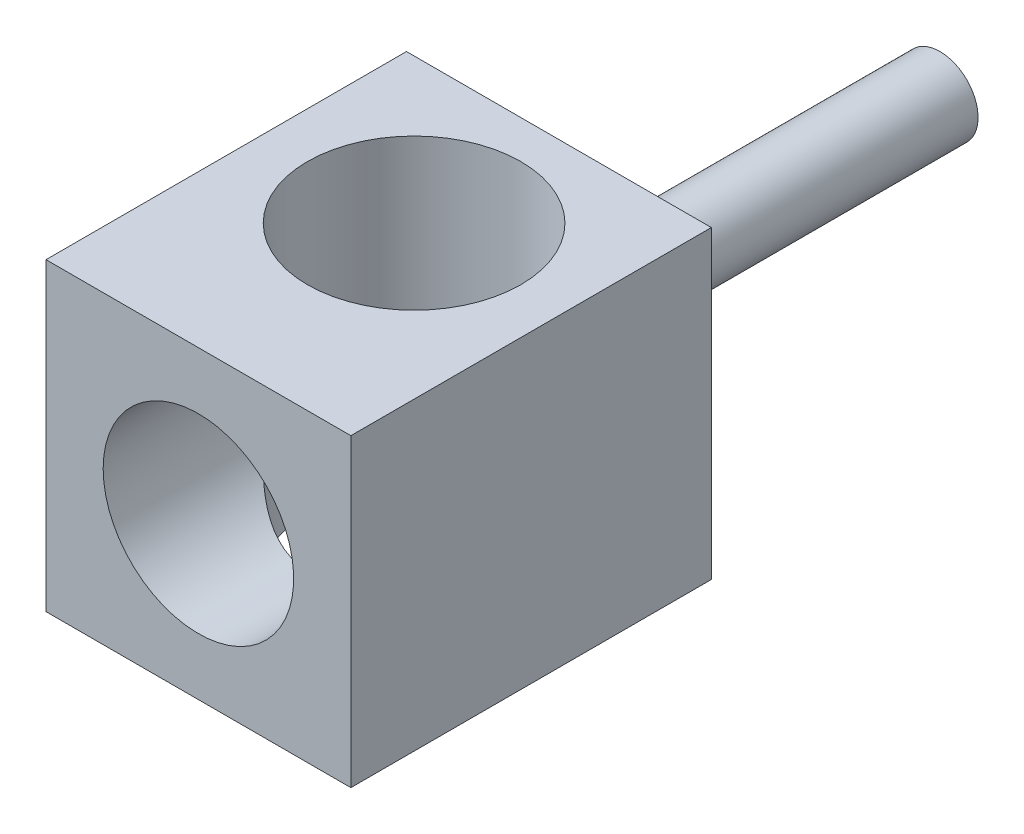
ISO-10303-21;
HEADER;
FILE_DESCRIPTION(('STEP AP214'),'2;1');
FILE_NAME('part.step','',(''),(''),'','','');
FILE_SCHEMA(('AUTOMOTIVE_DESIGN { 1 0 10303 214 1 1 1 1 }'));
ENDSEC;
DATA;
#1=APPLICATION_CONTEXT('core data for automotive mechanical design processes');
#2=APPLICATION_PROTOCOL_DEFINITION('international standard','automotive_design',2000,#1);
#3=PRODUCT_CONTEXT('',#1,'mechanical');
#4=PRODUCT('Part','Part','',(#3));
#5=PRODUCT_RELATED_PRODUCT_CATEGORY('part','',(#4));
#6=PRODUCT_DEFINITION_FORMATION('','',#4);
#7=PRODUCT_DEFINITION_CONTEXT('part definition',#1,'design');
#8=PRODUCT_DEFINITION('design','',#6,#7);
#9=PRODUCT_DEFINITION_SHAPE('','',#8);
#10=(LENGTH_UNIT() NAMED_UNIT(*) SI_UNIT(.MILLI.,.METRE.));
#11=(NAMED_UNIT(*) PLANE_ANGLE_UNIT() SI_UNIT($,.RADIAN.));
#12=(NAMED_UNIT(*) SI_UNIT($,.STERADIAN.) SOLID_ANGLE_UNIT());
#13=UNCERTAINTY_MEASURE_WITH_UNIT(LENGTH_MEASURE(1.E-05),#10,'distance_accuracy_value','');
#14=(GEOMETRIC_REPRESENTATION_CONTEXT(3) GLOBAL_UNCERTAINTY_ASSIGNED_CONTEXT((#13)) GLOBAL_UNIT_ASSIGNED_CONTEXT((#10,
#11,#12)) REPRESENTATION_CONTEXT('',''));
#15=CARTESIAN_POINT('',(0.,0.,0.));
#16=DIRECTION('',(0.,0.,1.));
#17=DIRECTION('',(1.,0.,0.));
#18=AXIS2_PLACEMENT_3D('',#15,#16,#17);
#19=CARTESIAN_POINT('',(0.,0.,-5.));
#20=DIRECTION('',(0.,0.,1.));
#21=DIRECTION('',(1.,0.,0.));
#22=AXIS2_PLACEMENT_3D('',#19,#20,#21);
#23=PLANE('',#22);
#24=CARTESIAN_POINT('',(0.,0.,-5.));
#25=DIRECTION('',(0.,0.,-1.));
#26=DIRECTION('',(-1.,0.,0.));
#27=AXIS2_PLACEMENT_3D('',#24,#25,#26);
#28=CIRCLE('',#27,0.5);
#29=CARTESIAN_POINT('',(-0.5,0.,-5.));
#30=VERTEX_POINT('',#29);
#31=EDGE_CURVE('E19',#30,#30,#28,.F.);
#32=ORIENTED_EDGE('',*,*,#31,.F.);
#33=EDGE_LOOP('',(#32));
#34=FACE_BOUND('',#33,.T.);
#35=ADVANCED_FACE('F16',(#34),#23,.F.);
#36=CARTESIAN_POINT('',(0.,0.,0.));
#37=DIRECTION('',(0.,0.,-1.));
#38=DIRECTION('',(-1.,0.,0.));
#39=AXIS2_PLACEMENT_3D('',#36,#37,#38);
#40=CYLINDRICAL_SURFACE('',#39,0.5);
#41=CARTESIAN_POINT('',(0.,0.,0.));
#42=DIRECTION('',(0.,0.,-1.));
#43=DIRECTION('',(-1.,0.,0.));
#44=AXIS2_PLACEMENT_3D('',#41,#42,#43);
#45=CIRCLE('',#44,0.5);
#46=CARTESIAN_POINT('',(-0.5,0.,0.));
#47=VERTEX_POINT('',#46);
#48=EDGE_CURVE('E87',#47,#47,#45,.T.);
#49=ORIENTED_EDGE('',*,*,#48,.T.);
#50=EDGE_LOOP('',(#49));
#51=FACE_BOUND('',#50,.T.);
#52=ORIENTED_EDGE('',*,*,#31,.T.);
#53=EDGE_LOOP('',(#52));
#54=FACE_BOUND('',#53,.T.);
#55=ADVANCED_FACE('F127',(#51,#54),#40,.T.);
#56=CARTESIAN_POINT('',(0.,0.,0.));
#57=DIRECTION('',(0.,0.,1.));
#58=DIRECTION('',(1.,0.,0.));
#59=AXIS2_PLACEMENT_3D('',#56,#57,#58);
#60=PLANE('',#59);
#61=ORIENTED_EDGE('',*,*,#48,.F.);
#62=EDGE_LOOP('',(#61));
#63=FACE_BOUND('',#62,.T.);
#64=DIRECTION('',(0.,1.,0.));
#65=VECTOR('',#64,1.);
#66=CARTESIAN_POINT('',(-2.,2.,0.));
#67=LINE('',#66,#65);
#68=CARTESIAN_POINT('',(-2.,2.,0.));
#69=VERTEX_POINT('',#68);
#70=CARTESIAN_POINT('',(-2.,-2.,0.));
#71=VERTEX_POINT('',#70);
#72=EDGE_CURVE('E56',#69,#71,#67,.F.);
#73=ORIENTED_EDGE('',*,*,#72,.F.);
#74=DIRECTION('',(1.,0.,0.));
#75=VECTOR('',#74,1.);
#76=CARTESIAN_POINT('',(2.,2.,0.));
#77=LINE('',#76,#75);
#78=CARTESIAN_POINT('',(2.,2.,0.));
#79=VERTEX_POINT('',#78);
#80=EDGE_CURVE('E74',#79,#69,#77,.F.);
#81=ORIENTED_EDGE('',*,*,#80,.F.);
#82=DIRECTION('',(0.,1.,0.));
#83=VECTOR('',#82,1.);
#84=CARTESIAN_POINT('',(2.,-2.,0.));
#85=LINE('',#84,#83);
#86=CARTESIAN_POINT('',(2.,-2.,0.));
#87=VERTEX_POINT('',#86);
#88=EDGE_CURVE('E72',#87,#79,#85,.T.);
#89=ORIENTED_EDGE('',*,*,#88,.F.);
#90=DIRECTION('',(1.,0.,0.));
#91=VECTOR('',#90,1.);
#92=CARTESIAN_POINT('',(-2.,-2.,0.));
#93=LINE('',#92,#91);
#94=EDGE_CURVE('E61',#71,#87,#93,.T.);
#95=ORIENTED_EDGE('',*,*,#94,.F.);
#96=EDGE_LOOP('',(#73,#81,#89,#95));
#97=FACE_BOUND('',#96,.T.);
#98=ADVANCED_FACE('F73',(#63,#97),#60,.F.);
#99=CARTESIAN_POINT('',(-2.,2.,0.));
#100=DIRECTION('',(-1.,0.,0.));
#101=DIRECTION('',(0.,0.,1.));
#102=AXIS2_PLACEMENT_3D('',#99,#100,#101);
#103=PLANE('',#102);
#104=DIRECTION('',(0.,1.,0.));
#105=VECTOR('',#104,1.);
#106=CARTESIAN_POINT('',(-2.,0.,4.73));
#107=LINE('',#106,#105);
#108=CARTESIAN_POINT('',(-2.,2.,4.73));
#109=VERTEX_POINT('',#108);
#110=CARTESIAN_POINT('',(-2.,-2.,4.73));
#111=VERTEX_POINT('',#110);
#112=EDGE_CURVE('E69',#109,#111,#107,.F.);
#113=ORIENTED_EDGE('',*,*,#112,.F.);
#114=DIRECTION('',(0.,0.,1.));
#115=VECTOR('',#114,1.);
#116=CARTESIAN_POINT('',(-2.,2.,0.));
#117=LINE('',#116,#115);
#118=EDGE_CURVE('E155',#69,#109,#117,.T.);
#119=ORIENTED_EDGE('',*,*,#118,.F.);
#120=ORIENTED_EDGE('',*,*,#72,.T.);
#121=DIRECTION('',(0.,0.,-1.));
#122=VECTOR('',#121,1.);
#123=CARTESIAN_POINT('',(-2.,-2.,0.));
#124=LINE('',#123,#122);
#125=EDGE_CURVE('E67',#111,#71,#124,.T.);
#126=ORIENTED_EDGE('',*,*,#125,.F.);
#127=EDGE_LOOP('',(#113,#119,#120,#126));
#128=FACE_BOUND('',#127,.T.);
#129=ADVANCED_FACE('F136',(#128),#103,.T.);
#130=CARTESIAN_POINT('',(2.,-2.,0.));
#131=DIRECTION('',(1.,0.,0.));
#132=DIRECTION('',(0.,0.,-1.));
#133=AXIS2_PLACEMENT_3D('',#130,#131,#132);
#134=PLANE('',#133);
#135=DIRECTION('',(0.,1.,0.));
#136=VECTOR('',#135,1.);
#137=CARTESIAN_POINT('',(2.,0.,4.73));
#138=LINE('',#137,#136);
#139=CARTESIAN_POINT('',(2.,-2.,4.73));
#140=VERTEX_POINT('',#139);
#141=CARTESIAN_POINT('',(2.,2.,4.73));
#142=VERTEX_POINT('',#141);
#143=EDGE_CURVE('E34',#140,#142,#138,.T.);
#144=ORIENTED_EDGE('',*,*,#143,.F.);
#145=DIRECTION('',(0.,0.,-1.));
#146=VECTOR('',#145,1.);
#147=CARTESIAN_POINT('',(2.,-2.,0.));
#148=LINE('',#147,#146);
#149=EDGE_CURVE('E66',#87,#140,#148,.F.);
#150=ORIENTED_EDGE('',*,*,#149,.F.);
#151=ORIENTED_EDGE('',*,*,#88,.T.);
#152=DIRECTION('',(0.,0.,1.));
#153=VECTOR('',#152,1.);
#154=CARTESIAN_POINT('',(2.,2.,0.));
#155=LINE('',#154,#153);
#156=EDGE_CURVE('E119',#142,#79,#155,.F.);
#157=ORIENTED_EDGE('',*,*,#156,.F.);
#158=EDGE_LOOP('',(#144,#150,#151,#157));
#159=FACE_BOUND('',#158,.T.);
#160=ADVANCED_FACE('F79',(#159),#134,.T.);
#161=CARTESIAN_POINT('',(0.,0.,4.73));
#162=DIRECTION('',(0.,0.,1.));
#163=DIRECTION('',(1.,0.,0.));
#164=AXIS2_PLACEMENT_3D('',#161,#162,#163);
#165=PLANE('',#164);
#166=CARTESIAN_POINT('',(0.,0.,4.73));
#167=DIRECTION('',(0.,0.,-1.));
#168=DIRECTION('',(-1.,0.,0.));
#169=AXIS2_PLACEMENT_3D('',#166,#167,#168);
#170=CIRCLE('',#169,1.25);
#171=CARTESIAN_POINT('',(-1.25,0.,4.73));
#172=VERTEX_POINT('',#171);
#173=EDGE_CURVE('E117',#172,#172,#170,.T.);
#174=ORIENTED_EDGE('',*,*,#173,.T.);
#175=EDGE_LOOP('',(#174));
#176=FACE_BOUND('',#175,.T.);
#177=DIRECTION('',(1.,0.,0.));
#178=VECTOR('',#177,1.);
#179=CARTESIAN_POINT('',(2.,2.,4.73));
#180=LINE('',#179,#178);
#181=EDGE_CURVE('E154',#109,#142,#180,.T.);
#182=ORIENTED_EDGE('',*,*,#181,.F.);
#183=ORIENTED_EDGE('',*,*,#112,.T.);
#184=DIRECTION('',(1.,0.,0.));
#185=VECTOR('',#184,1.);
#186=CARTESIAN_POINT('',(-2.,-2.,4.73));
#187=LINE('',#186,#185);
#188=EDGE_CURVE('E80',#140,#111,#187,.F.);
#189=ORIENTED_EDGE('',*,*,#188,.F.);
#190=ORIENTED_EDGE('',*,*,#143,.T.);
#191=EDGE_LOOP('',(#182,#183,#189,#190));
#192=FACE_BOUND('',#191,.T.);
#193=ADVANCED_FACE('F144',(#176,#192),#165,.T.);
#194=CARTESIAN_POINT('',(-2.,-2.,0.));
#195=DIRECTION('',(0.,-1.,0.));
#196=DIRECTION('',(0.,0.,-1.));
#197=AXIS2_PLACEMENT_3D('',#194,#195,#196);
#198=PLANE('',#197);
#199=CARTESIAN_POINT('',(0.,-2.,1.9));
#200=DIRECTION('',(0.,1.,0.));
#201=DIRECTION('',(0.,0.,1.));
#202=AXIS2_PLACEMENT_3D('',#199,#200,#201);
#203=CIRCLE('',#202,1.4);
#204=CARTESIAN_POINT('',(0.,-2.,3.3));
#205=VERTEX_POINT('',#204);
#206=EDGE_CURVE('E115',#205,#205,#203,.T.);
#207=ORIENTED_EDGE('',*,*,#206,.T.);
#208=EDGE_LOOP('',(#207));
#209=FACE_BOUND('',#208,.T.);
#210=ORIENTED_EDGE('',*,*,#188,.T.);
#211=ORIENTED_EDGE('',*,*,#125,.T.);
#212=ORIENTED_EDGE('',*,*,#94,.T.);
#213=ORIENTED_EDGE('',*,*,#149,.T.);
#214=EDGE_LOOP('',(#210,#211,#212,#213));
#215=FACE_BOUND('',#214,.T.);
#216=ADVANCED_FACE('F64',(#209,#215),#198,.T.);
#217=CARTESIAN_POINT('',(2.,2.,0.));
#218=DIRECTION('',(0.,1.,0.));
#219=DIRECTION('',(0.,0.,1.));
#220=AXIS2_PLACEMENT_3D('',#217,#218,#219);
#221=PLANE('',#220);
#222=CARTESIAN_POINT('',(0.,2.,1.9));
#223=DIRECTION('',(0.,1.,0.));
#224=DIRECTION('',(0.,0.,1.));
#225=AXIS2_PLACEMENT_3D('',#222,#223,#224);
#226=CIRCLE('',#225,1.4);
#227=CARTESIAN_POINT('',(0.,2.,3.3));
#228=VERTEX_POINT('',#227);
#229=EDGE_CURVE('E25',#228,#228,#226,.F.);
#230=ORIENTED_EDGE('',*,*,#229,.T.);
#231=EDGE_LOOP('',(#230));
#232=FACE_BOUND('',#231,.T.);
#233=ORIENTED_EDGE('',*,*,#181,.T.);
#234=ORIENTED_EDGE('',*,*,#156,.T.);
#235=ORIENTED_EDGE('',*,*,#80,.T.);
#236=ORIENTED_EDGE('',*,*,#118,.T.);
#237=EDGE_LOOP('',(#233,#234,#235,#236));
#238=FACE_BOUND('',#237,.T.);
#239=ADVANCED_FACE('F106',(#232,#238),#221,.T.);
#240=CARTESIAN_POINT('',(0.,0.,4.73));
#241=DIRECTION('',(0.,0.,-1.));
#242=DIRECTION('',(-1.,0.,0.));
#243=AXIS2_PLACEMENT_3D('',#240,#241,#242);
#244=CYLINDRICAL_SURFACE('',#243,1.25);
#245=CARTESIAN_POINT('',(-1.25,0.,2.53047601064592));
#246=CARTESIAN_POINT('',(-1.25000124449637,0.038291403358644,2.53047172640027));
#247=CARTESIAN_POINT('',(-1.24821892540852,0.0765777004818174,2.53404251967174));
#248=CARTESIAN_POINT('',(-1.24132780435685,0.151801704068977,2.54742423741934));
#249=CARTESIAN_POINT('',(-1.23620581779665,0.18873344993332,2.55725989122156));
#250=CARTESIAN_POINT('',(-1.22001369250822,0.277406173763262,2.58699461523157));
#251=CARTESIAN_POINT('',(-1.20727913768111,0.32794519874401,2.60945096195065));
#252=CARTESIAN_POINT('',(-1.17665653334209,0.424949747019349,2.65917110337674));
#253=CARTESIAN_POINT('',(-1.1587494513436,0.471399384334545,2.68645250562304));
#254=CARTESIAN_POINT('',(-1.12151897194258,0.553511743506078,2.73848026010289));
#255=CARTESIAN_POINT('',(-1.10290258365258,0.589698386039483,2.76291465590356));
#256=CARTESIAN_POINT('',(-1.06242316452454,0.659847294957215,2.81229361784028));
#257=CARTESIAN_POINT('',(-1.04055818060518,0.693808205390143,2.83723848304128));
#258=CARTESIAN_POINT('',(-0.970127576255164,0.792385975854767,2.91168147530337));
#259=CARTESIAN_POINT('',(-0.916651619955866,0.853861577176749,2.96089926138135));
#260=CARTESIAN_POINT('',(-0.810760382999214,0.953469067854883,3.04281743208855));
#261=CARTESIAN_POINT('',(-0.761150361866222,0.993667529124868,3.07665291526125));
#262=CARTESIAN_POINT('',(-0.654196443561567,1.06710743894285,3.13929275616413));
#263=CARTESIAN_POINT('',(-0.596866266183241,1.1003609680996,3.16810583560351));
#264=CARTESIAN_POINT('',(-0.486857486219283,1.1525733230873,3.21369666891938));
#265=CARTESIAN_POINT('',(-0.435423600083039,1.17305294239357,3.23172434191068));
#266=CARTESIAN_POINT('',(-0.328728430590489,1.20729822549178,3.26198530894496));
#267=CARTESIAN_POINT('',(-0.273469439797153,1.22106787176671,3.27422203988566));
#268=CARTESIAN_POINT('',(-0.160183472827446,1.24103391818331,3.29199292333045));
#269=CARTESIAN_POINT('',(-0.102142404270044,1.24718630433586,3.2974881203103));
#270=CARTESIAN_POINT('',(0.0144560706445098,1.2512754441944,3.30113852664052));
#271=CARTESIAN_POINT('',(0.0730133236482344,1.24921456101228,3.2992958472359));
#272=CARTESIAN_POINT('',(0.183154886537647,1.23763206297857,3.28896632718614));
#273=CARTESIAN_POINT('',(0.234878840693946,1.22882683865439,3.28111753322941));
#274=CARTESIAN_POINT('',(0.335786977470305,1.20516998238412,3.26011221360893));
#275=CARTESIAN_POINT('',(0.384970560767918,1.19031693091474,3.24695444184841));
#276=CARTESIAN_POINT('',(0.482697293281563,1.15428573678654,3.21521786076044));
#277=CARTESIAN_POINT('',(0.531030727262871,1.13278560584965,3.1963645797923));
#278=CARTESIAN_POINT('',(0.623236066517156,1.08479599852239,3.15464858590542));
#279=CARTESIAN_POINT('',(0.667106824042449,1.0583052435735,3.1317848456423));
#280=CARTESIAN_POINT('',(0.771947081634623,0.986156289505623,3.07024657096457));
#281=CARTESIAN_POINT('',(0.829840477855284,0.93772509687612,3.02956219020811));
#282=CARTESIAN_POINT('',(0.934945280424212,0.833018098286289,2.94426656156275));
#283=CARTESIAN_POINT('',(0.982109180361475,0.776709121685885,2.89963901945557));
#284=CARTESIAN_POINT('',(1.06689217534322,0.655630703502069,2.80865698042749));
#285=CARTESIAN_POINT('',(1.10425307193401,0.590689692848189,2.76228681202795));
#286=CARTESIAN_POINT('',(1.15173041424882,0.487276751125874,2.69640351322365));
#287=CARTESIAN_POINT('',(1.16611129041663,0.451872123490128,2.67508822095124));
#288=CARTESIAN_POINT('',(1.191877656089,0.378722918924544,2.63484162801368));
#289=CARTESIAN_POINT('',(1.20326837049071,0.340982567935125,2.61590619946051));
#290=CARTESIAN_POINT('',(1.22121653403381,0.268863587269429,2.58476546860755));
#291=CARTESIAN_POINT('',(1.22824854861652,0.234864711366705,2.57197253964494));
#292=CARTESIAN_POINT('',(1.23954892963005,0.165104839747833,2.55089389538503));
#293=CARTESIAN_POINT('',(1.2438261481274,0.12934988954517,2.54259375713124));
#294=CARTESIAN_POINT('',(1.24927841931571,0.0562024209861184,2.53193743178652));
#295=CARTESIAN_POINT('',(1.250413605934,0.0187949228781497,2.52965764738584));
#296=CARTESIAN_POINT('',(1.24931269872641,-0.0557869057348426,2.53183686281426));
#297=CARTESIAN_POINT('',(1.24707366839832,-0.092961004837842,2.5363017323663));
#298=CARTESIAN_POINT('',(1.238879433652,-0.171755980485154,2.55212265688191));
#299=CARTESIAN_POINT('',(1.23237401482609,-0.213103736034391,2.56449056776674));
#300=CARTESIAN_POINT('',(1.21581652898876,-0.293219429330206,2.59431885124704));
#301=CARTESIAN_POINT('',(1.20575054113208,-0.331976520786076,2.61179916479553));
#302=CARTESIAN_POINT('',(1.18350748525111,-0.403861118971263,2.64814918833864));
#303=CARTESIAN_POINT('',(1.17157562832231,-0.437188745033645,2.66678242244813));
#304=CARTESIAN_POINT('',(1.14529883497249,-0.502009169843356,2.70550658874423));
#305=CARTESIAN_POINT('',(1.13095195543781,-0.533500463396045,2.72559868726299));
#306=CARTESIAN_POINT('',(1.08439263339925,-0.625570923363982,2.78697114045301));
#307=CARTESIAN_POINT('',(1.04867682307322,-0.683698754485452,2.82932079464615));
#308=CARTESIAN_POINT('',(0.964527761344926,-0.798542878762434,2.91671006345157));
#309=CARTESIAN_POINT('',(0.915268304200186,-0.854713631943699,2.96167011339398));
#310=CARTESIAN_POINT('',(0.805530929587432,-0.958805081218428,3.0471418026039));
#311=CARTESIAN_POINT('',(0.74508173147366,-1.00674630523938,3.08766441642178));
#312=CARTESIAN_POINT('',(0.631552958716361,-1.08020454927352,3.15063859135504));
#313=CARTESIAN_POINT('',(0.581152289341848,-1.10824122233895,3.1749725184266));
#314=CARTESIAN_POINT('',(0.475003583715133,-1.15770996412553,3.21819827831962));
#315=CARTESIAN_POINT('',(0.419258486833801,-1.17914563630136,3.23709307996482));
#316=CARTESIAN_POINT('',(0.302962927856045,-1.21426122929602,3.26816040565654));
#317=CARTESIAN_POINT('',(0.242374332849025,-1.22787089347673,3.28027201027397));
#318=CARTESIAN_POINT('',(0.118796342801721,-1.24590269488228,3.29633667091598));
#319=CARTESIAN_POINT('',(0.0558092891839411,-1.25033356975434,3.30029748597098));
#320=CARTESIAN_POINT('',(-0.0615241184741592,-1.24967381284388,3.2997090592209));
#321=CARTESIAN_POINT('',(-0.11588887674067,-1.24578798217361,3.29623662366538));
#322=CARTESIAN_POINT('',(-0.222921068042805,-1.2311471848079,3.28318918420628));
#323=CARTESIAN_POINT('',(-0.27558840989783,-1.22039184974524,3.27361385304382));
#324=CARTESIAN_POINT('',(-0.37733116069238,-1.1928417281861,3.24919651392738));
#325=CARTESIAN_POINT('',(-0.426440286386881,-1.17611617686999,3.23441490698593));
#326=CARTESIAN_POINT('',(-0.520910009670551,-1.13743680939653,3.20045272168725));
#327=CARTESIAN_POINT('',(-0.566268900396509,-1.11548063005094,3.18127015512966));
#328=CARTESIAN_POINT('',(-0.672656551994458,-1.05605788976326,3.12981460728889));
#329=CARTESIAN_POINT('',(-0.731341392693063,-1.01609426803914,3.09557107754984));
#330=CARTESIAN_POINT('',(-0.839519194919248,-0.928744313371244,3.02227211765274));
#331=CARTESIAN_POINT('',(-0.888990130337536,-0.881340680503065,2.98320551897791));
#332=CARTESIAN_POINT('',(-0.979788353889426,-0.779282441014964,2.90190084496077));
#333=CARTESIAN_POINT('',(-1.0209189414931,-0.724494489222744,2.85961282447771));
#334=CARTESIAN_POINT('',(-1.09387901337848,-0.608783266092404,2.77549744304343));
#335=CARTESIAN_POINT('',(-1.1257212189368,-0.547868541258855,2.73366952826057));
#336=CARTESIAN_POINT('',(-1.16857474394003,-0.445641810986782,2.67150443937466));
#337=CARTESIAN_POINT('',(-1.18274547307314,-0.406693362763877,2.64945568884174));
#338=CARTESIAN_POINT('',(-1.20751700985524,-0.325867393881992,2.6088464975148));
#339=CARTESIAN_POINT('',(-1.21811928718842,-0.283991087678954,2.59028462202964));
#340=CARTESIAN_POINT('',(-1.23413600825497,-0.202294106648688,2.56117655152276));
#341=CARTESIAN_POINT('',(-1.24001915527983,-0.162826268768838,2.54993733465782));
#342=CARTESIAN_POINT('',(-1.24794126955711,-0.0822310353259754,2.53460649158322));
#343=CARTESIAN_POINT('',(-1.24999866381368,-0.0411125744775748,2.53048061053919));
#344=CARTESIAN_POINT('',(-1.25,0.,2.53047601064592));
#345=B_SPLINE_CURVE_WITH_KNOTS('',3,(#245,#246,#247,#248,#249,#250,#251,#252,#253,#254,#255,
#256,#257,#258,#259,#260,#261,#262,#263,#264,#265,#266,#267,#268,#269,#270,#271,#272,#273,#274,
#275,#276,#277,#278,#279,#280,#281,#282,#283,#284,#285,#286,#287,#288,#289,#290,#291,#292,#293,
#294,#295,#296,#297,#298,#299,#300,#301,#302,#303,#304,#305,#306,#307,#308,#309,#310,#311,#312,
#313,#314,#315,#316,#317,#318,#319,#320,#321,#322,#323,#324,#325,#326,#327,#328,#329,#330,#331,
#332,#333,#334,#335,#336,#337,#338,#339,#340,#341,#342,#343,#344),.UNSPECIFIED.,.T.,.F.,(4,2,2,
2,2,2,2,2,2,2,2,2,2,2,2,2,2,2,2,2,2,2,2,2,2,2,2,2,2,2,2,2,2,2,2,2,2,2,2,2,2,2,2,2,2,2,2,2,2,4),
(0.,0.114692878167487,0.229841313872778,0.39913304467203,0.569055802778119,0.711272334476729,
0.853574716474219,1.13755184956108,1.35361023871497,1.5692896082112,1.74325685491376,
1.9171207229595,2.09198459079853,2.26679815065048,2.42524892228969,2.5837369063578,
2.75159341285771,2.91949298149597,3.17531368121349,3.43224592631143,3.69538709154212,
3.82650352960332,3.95738931124846,4.06808057635878,4.17841435562299,4.29014176840363,
4.40196647111011,4.53216729252868,4.66288289464787,4.78272675532571,4.90266750668186,
5.14271833919975,5.40329192124101,5.66320576712,5.85031250718714,6.03731692477391,
6.22597493709987,6.41445327583021,6.57748363361576,6.7405227344019,6.90172945886987,
7.06300915483236,7.29819269227665,7.53393142240913,7.77470969437894,8.01515663358751,
8.15575872352198,8.29630283474026,8.42004343098415,8.54318646263393),.UNSPECIFIED.);
#346=CARTESIAN_POINT('',(-1.25,0.,2.53047601064592));
#347=VERTEX_POINT('',#346);
#348=EDGE_CURVE('E10',#347,#347,#345,.T.);
#349=ORIENTED_EDGE('',*,*,#348,.T.);
#350=EDGE_LOOP('',(#349));
#351=FACE_BOUND('',#350,.T.);
#352=ORIENTED_EDGE('',*,*,#173,.F.);
#353=EDGE_LOOP('',(#352));
#354=FACE_BOUND('',#353,.T.);
#355=ADVANCED_FACE('F95',(#351,#354),#244,.F.);
#356=CARTESIAN_POINT('',(0.,-2.,1.9));
#357=DIRECTION('',(0.,1.,0.));
#358=DIRECTION('',(0.,0.,1.));
#359=AXIS2_PLACEMENT_3D('',#356,#357,#358);
#360=CYLINDRICAL_SURFACE('',#359,1.4);
#361=ORIENTED_EDGE('',*,*,#348,.F.);
#362=EDGE_LOOP('',(#361));
#363=FACE_BOUND('',#362,.T.);
#364=ORIENTED_EDGE('',*,*,#229,.F.);
#365=EDGE_LOOP('',(#364));
#366=FACE_BOUND('',#365,.T.);
#367=ORIENTED_EDGE('',*,*,#206,.F.);
#368=EDGE_LOOP('',(#367));
#369=FACE_BOUND('',#368,.T.);
#370=ADVANCED_FACE('F98',(#363,#366,#369),#360,.F.);
#371=CLOSED_SHELL('',(#35,#55,#98,#129,#160,#193,#216,#239,#355,#370));
#372=MANIFOLD_SOLID_BREP('B1',#371);
#373=ADVANCED_BREP_SHAPE_REPRESENTATION('',(#18,#372),#14);
#374=SHAPE_DEFINITION_REPRESENTATION(#9,#373);
ENDSEC;
END-ISO-10303-21;
